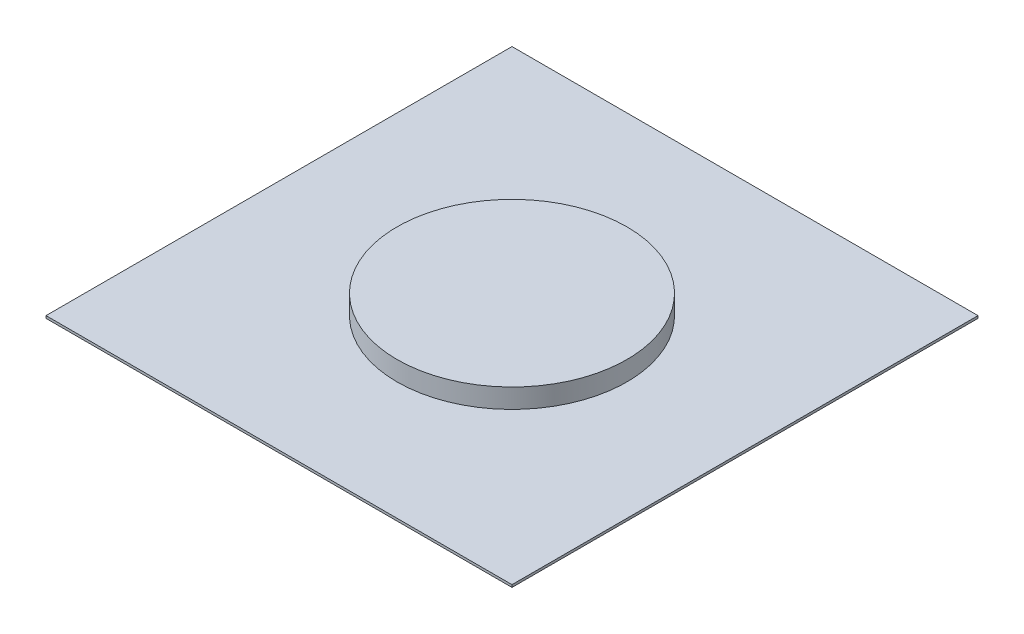
ISO-10303-21;
HEADER;
FILE_DESCRIPTION(('STEP AP214'),'2;1');
FILE_NAME('part.step','',(''),(''),'','','');
FILE_SCHEMA(('AUTOMOTIVE_DESIGN { 1 0 10303 214 1 1 1 1 }'));
ENDSEC;
DATA;
#1=APPLICATION_CONTEXT('core data for automotive mechanical design processes');
#2=APPLICATION_PROTOCOL_DEFINITION('international standard','automotive_design',2000,#1);
#3=PRODUCT_CONTEXT('',#1,'mechanical');
#4=PRODUCT('Part','Part','',(#3));
#5=PRODUCT_RELATED_PRODUCT_CATEGORY('part','',(#4));
#6=PRODUCT_DEFINITION_FORMATION('','',#4);
#7=PRODUCT_DEFINITION_CONTEXT('part definition',#1,'design');
#8=PRODUCT_DEFINITION('design','',#6,#7);
#9=PRODUCT_DEFINITION_SHAPE('','',#8);
#10=(LENGTH_UNIT() NAMED_UNIT(*) SI_UNIT(.MILLI.,.METRE.));
#11=(NAMED_UNIT(*) PLANE_ANGLE_UNIT() SI_UNIT($,.RADIAN.));
#12=(NAMED_UNIT(*) SI_UNIT($,.STERADIAN.) SOLID_ANGLE_UNIT());
#13=UNCERTAINTY_MEASURE_WITH_UNIT(LENGTH_MEASURE(1.E-05),#10,'distance_accuracy_value','');
#14=(GEOMETRIC_REPRESENTATION_CONTEXT(3) GLOBAL_UNCERTAINTY_ASSIGNED_CONTEXT((#13)) GLOBAL_UNIT_ASSIGNED_CONTEXT((#10,
#11,#12)) REPRESENTATION_CONTEXT('',''));
#15=CARTESIAN_POINT('',(0.,0.,0.));
#16=DIRECTION('',(0.,0.,1.));
#17=DIRECTION('',(1.,0.,0.));
#18=AXIS2_PLACEMENT_3D('',#15,#16,#17);
#19=CARTESIAN_POINT('',(0.,25.4,0.));
#20=DIRECTION('',(0.,-1.,0.));
#21=DIRECTION('',(0.,0.,-1.));
#22=AXIS2_PLACEMENT_3D('',#19,#20,#21);
#23=CYLINDRICAL_SURFACE('',#22,150.36165);
#24=CARTESIAN_POINT('',(0.,25.4,0.));
#25=DIRECTION('',(0.,1.,0.));
#26=DIRECTION('',(0.,0.,1.));
#27=AXIS2_PLACEMENT_3D('',#24,#25,#26);
#28=CIRCLE('',#27,150.36165);
#29=CARTESIAN_POINT('',(0.,25.4,150.36165));
#30=VERTEX_POINT('',#29);
#31=EDGE_CURVE('E11',#30,#30,#28,.T.);
#32=ORIENTED_EDGE('',*,*,#31,.F.);
#33=EDGE_LOOP('',(#32));
#34=FACE_BOUND('',#33,.T.);
#35=CARTESIAN_POINT('',(0.,0.,0.));
#36=DIRECTION('',(0.,1.,0.));
#37=DIRECTION('',(0.,0.,1.));
#38=AXIS2_PLACEMENT_3D('',#35,#36,#37);
#39=CIRCLE('',#38,150.36165);
#40=CARTESIAN_POINT('',(0.,0.,150.36165));
#41=VERTEX_POINT('',#40);
#42=EDGE_CURVE('E374',#41,#41,#39,.T.);
#43=ORIENTED_EDGE('',*,*,#42,.T.);
#44=EDGE_LOOP('',(#43));
#45=FACE_BOUND('',#44,.T.);
#46=ADVANCED_FACE('F368',(#34,#45),#23,.T.);
#47=CARTESIAN_POINT('',(0.,25.4,0.));
#48=DIRECTION('',(0.,1.,0.));
#49=DIRECTION('',(0.,0.,1.));
#50=AXIS2_PLACEMENT_3D('',#47,#48,#49);
#51=PLANE('',#50);
#52=ORIENTED_EDGE('',*,*,#31,.T.);
#53=EDGE_LOOP('',(#52));
#54=FACE_BOUND('',#53,.T.);
#55=ADVANCED_FACE('F383',(#54),#51,.T.);
#56=CARTESIAN_POINT('',(0.,0.,0.));
#57=DIRECTION('',(0.,1.,0.));
#58=DIRECTION('',(0.,0.,1.));
#59=AXIS2_PLACEMENT_3D('',#56,#57,#58);
#60=PLANE('',#59);
#61=ORIENTED_EDGE('',*,*,#42,.F.);
#62=EDGE_LOOP('',(#61));
#63=FACE_BOUND('',#62,.T.);
#64=ADVANCED_FACE('F381',(#63),#60,.F.);
#65=CLOSED_SHELL('',(#46,#55,#64));
#66=MANIFOLD_SOLID_BREP('B2',#65);
#67=CARTESIAN_POINT('',(-304.8,-3.175,-304.8));
#68=DIRECTION('',(-1.,0.,0.));
#69=DIRECTION('',(0.,0.,1.));
#70=AXIS2_PLACEMENT_3D('',#67,#68,#69);
#71=PLANE('',#70);
#72=DIRECTION('',(0.,0.,1.));
#73=VECTOR('',#72,1.);
#74=CARTESIAN_POINT('',(-304.8,0.,-304.8));
#75=LINE('',#74,#73);
#76=CARTESIAN_POINT('',(-304.8,0.,-304.8));
#77=VERTEX_POINT('',#76);
#78=CARTESIAN_POINT('',(-304.8,0.,304.8));
#79=VERTEX_POINT('',#78);
#80=EDGE_CURVE('E442',#77,#79,#75,.T.);
#81=ORIENTED_EDGE('',*,*,#80,.F.);
#82=DIRECTION('',(0.,1.,0.));
#83=VECTOR('',#82,1.);
#84=CARTESIAN_POINT('',(-304.8,-3.175,-304.8));
#85=LINE('',#84,#83);
#86=CARTESIAN_POINT('',(-304.8,-3.175,-304.8));
#87=VERTEX_POINT('',#86);
#88=EDGE_CURVE('E366',#87,#77,#85,.T.);
#89=ORIENTED_EDGE('',*,*,#88,.F.);
#90=DIRECTION('',(0.,0.,1.));
#91=VECTOR('',#90,1.);
#92=CARTESIAN_POINT('',(-304.8,-3.175,-304.8));
#93=LINE('',#92,#91);
#94=CARTESIAN_POINT('',(-304.8,-3.175,304.8));
#95=VERTEX_POINT('',#94);
#96=EDGE_CURVE('E444',#87,#95,#93,.T.);
#97=ORIENTED_EDGE('',*,*,#96,.T.);
#98=DIRECTION('',(0.,1.,0.));
#99=VECTOR('',#98,1.);
#100=CARTESIAN_POINT('',(-304.8,-3.175,304.8));
#101=LINE('',#100,#99);
#102=EDGE_CURVE('E405',#95,#79,#101,.T.);
#103=ORIENTED_EDGE('',*,*,#102,.T.);
#104=EDGE_LOOP('',(#81,#89,#97,#103));
#105=FACE_BOUND('',#104,.T.);
#106=ADVANCED_FACE('F402',(#105),#71,.T.);
#107=CARTESIAN_POINT('',(-304.8,-3.175,-304.8));
#108=DIRECTION('',(0.,0.,-1.));
#109=DIRECTION('',(-1.,0.,0.));
#110=AXIS2_PLACEMENT_3D('',#107,#108,#109);
#111=PLANE('',#110);
#112=DIRECTION('',(-1.,0.,0.));
#113=VECTOR('',#112,1.);
#114=CARTESIAN_POINT('',(-304.8,0.,-304.8));
#115=LINE('',#114,#113);
#116=CARTESIAN_POINT('',(304.8,0.,-304.8));
#117=VERTEX_POINT('',#116);
#118=EDGE_CURVE('E459',#117,#77,#115,.T.);
#119=ORIENTED_EDGE('',*,*,#118,.F.);
#120=DIRECTION('',(0.,1.,0.));
#121=VECTOR('',#120,1.);
#122=CARTESIAN_POINT('',(304.8,-3.175,-304.8));
#123=LINE('',#122,#121);
#124=CARTESIAN_POINT('',(304.8,-3.175,-304.8));
#125=VERTEX_POINT('',#124);
#126=EDGE_CURVE('E410',#125,#117,#123,.T.);
#127=ORIENTED_EDGE('',*,*,#126,.F.);
#128=DIRECTION('',(-1.,0.,0.));
#129=VECTOR('',#128,1.);
#130=CARTESIAN_POINT('',(-304.8,-3.175,-304.8));
#131=LINE('',#130,#129);
#132=EDGE_CURVE('E449',#125,#87,#131,.T.);
#133=ORIENTED_EDGE('',*,*,#132,.T.);
#134=ORIENTED_EDGE('',*,*,#88,.T.);
#135=EDGE_LOOP('',(#119,#127,#133,#134));
#136=FACE_BOUND('',#135,.T.);
#137=ADVANCED_FACE('F474',(#136),#111,.T.);
#138=CARTESIAN_POINT('',(304.8,-3.175,-304.8));
#139=DIRECTION('',(1.,0.,0.));
#140=DIRECTION('',(0.,0.,-1.));
#141=AXIS2_PLACEMENT_3D('',#138,#139,#140);
#142=PLANE('',#141);
#143=DIRECTION('',(0.,0.,-1.));
#144=VECTOR('',#143,1.);
#145=CARTESIAN_POINT('',(304.8,0.,-304.8));
#146=LINE('',#145,#144);
#147=CARTESIAN_POINT('',(304.8,0.,304.8));
#148=VERTEX_POINT('',#147);
#149=EDGE_CURVE('E456',#148,#117,#146,.T.);
#150=ORIENTED_EDGE('',*,*,#149,.F.);
#151=DIRECTION('',(0.,1.,0.));
#152=VECTOR('',#151,1.);
#153=CARTESIAN_POINT('',(304.8,-3.175,304.8));
#154=LINE('',#153,#152);
#155=CARTESIAN_POINT('',(304.8,-3.175,304.8));
#156=VERTEX_POINT('',#155);
#157=EDGE_CURVE('E448',#156,#148,#154,.T.);
#158=ORIENTED_EDGE('',*,*,#157,.F.);
#159=DIRECTION('',(0.,0.,-1.));
#160=VECTOR('',#159,1.);
#161=CARTESIAN_POINT('',(304.8,-3.175,-304.8));
#162=LINE('',#161,#160);
#163=EDGE_CURVE('E467',#156,#125,#162,.T.);
#164=ORIENTED_EDGE('',*,*,#163,.T.);
#165=ORIENTED_EDGE('',*,*,#126,.T.);
#166=EDGE_LOOP('',(#150,#158,#164,#165));
#167=FACE_BOUND('',#166,.T.);
#168=ADVANCED_FACE('F471',(#167),#142,.T.);
#169=CARTESIAN_POINT('',(-304.8,-3.175,304.8));
#170=DIRECTION('',(0.,0.,1.));
#171=DIRECTION('',(1.,0.,0.));
#172=AXIS2_PLACEMENT_3D('',#169,#170,#171);
#173=PLANE('',#172);
#174=DIRECTION('',(1.,0.,0.));
#175=VECTOR('',#174,1.);
#176=CARTESIAN_POINT('',(-304.8,0.,304.8));
#177=LINE('',#176,#175);
#178=EDGE_CURVE('E451',#79,#148,#177,.T.);
#179=ORIENTED_EDGE('',*,*,#178,.F.);
#180=ORIENTED_EDGE('',*,*,#102,.F.);
#181=DIRECTION('',(1.,0.,0.));
#182=VECTOR('',#181,1.);
#183=CARTESIAN_POINT('',(-304.8,-3.175,304.8));
#184=LINE('',#183,#182);
#185=EDGE_CURVE('E465',#95,#156,#184,.T.);
#186=ORIENTED_EDGE('',*,*,#185,.T.);
#187=ORIENTED_EDGE('',*,*,#157,.T.);
#188=EDGE_LOOP('',(#179,#180,#186,#187));
#189=FACE_BOUND('',#188,.T.);
#190=ADVANCED_FACE('F452',(#189),#173,.T.);
#191=CARTESIAN_POINT('',(-304.8,-3.175,304.8));
#192=DIRECTION('',(0.,1.,0.));
#193=DIRECTION('',(0.,0.,1.));
#194=AXIS2_PLACEMENT_3D('',#191,#192,#193);
#195=PLANE('',#194);
#196=ORIENTED_EDGE('',*,*,#96,.F.);
#197=ORIENTED_EDGE('',*,*,#132,.F.);
#198=ORIENTED_EDGE('',*,*,#163,.F.);
#199=ORIENTED_EDGE('',*,*,#185,.F.);
#200=EDGE_LOOP('',(#196,#197,#198,#199));
#201=FACE_BOUND('',#200,.T.);
#202=ADVANCED_FACE('F476',(#201),#195,.F.);
#203=CARTESIAN_POINT('',(-304.8,0.,304.8));
#204=DIRECTION('',(0.,1.,0.));
#205=DIRECTION('',(0.,0.,1.));
#206=AXIS2_PLACEMENT_3D('',#203,#204,#205);
#207=PLANE('',#206);
#208=ORIENTED_EDGE('',*,*,#80,.T.);
#209=ORIENTED_EDGE('',*,*,#178,.T.);
#210=ORIENTED_EDGE('',*,*,#149,.T.);
#211=ORIENTED_EDGE('',*,*,#118,.T.);
#212=EDGE_LOOP('',(#208,#209,#210,#211));
#213=FACE_BOUND('',#212,.T.);
#214=ADVANCED_FACE('F458',(#213),#207,.T.);
#215=CLOSED_SHELL('',(#106,#137,#168,#190,#202,#214));
#216=MANIFOLD_SOLID_BREP('B6',#215);
#217=ADVANCED_BREP_SHAPE_REPRESENTATION('',(#18,#66,#216),#14);
#218=SHAPE_DEFINITION_REPRESENTATION(#9,#217);
ENDSEC;
END-ISO-10303-21;
